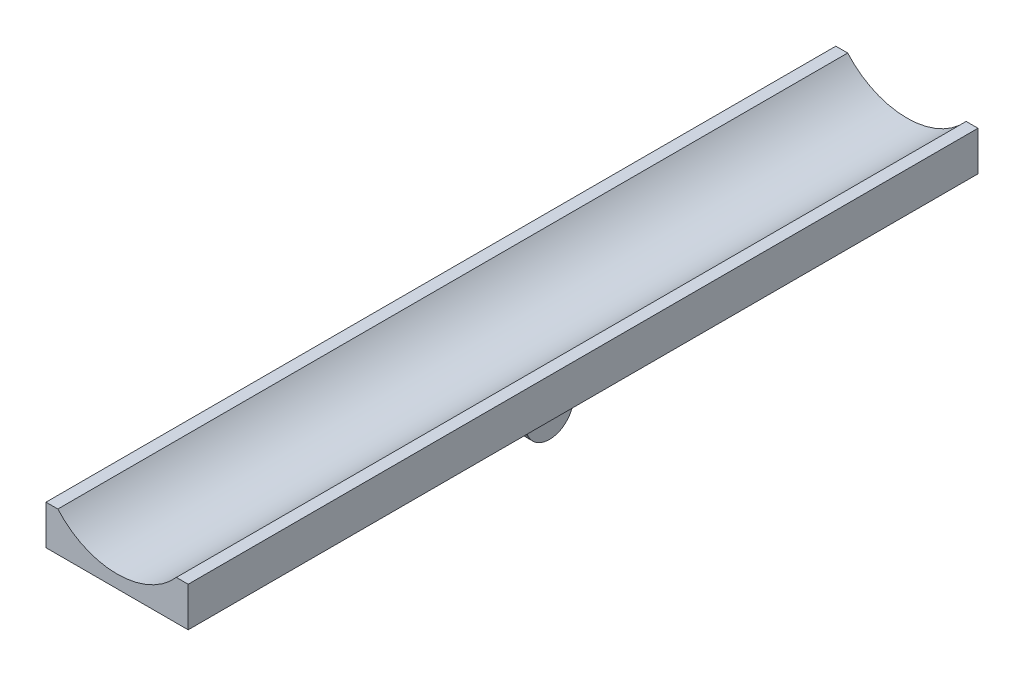
ISO-10303-21;
HEADER;
FILE_DESCRIPTION(('STEP AP214'),'2;1');
FILE_NAME('part.step','',(''),(''),'','','');
FILE_SCHEMA(('AUTOMOTIVE_DESIGN { 1 0 10303 214 1 1 1 1 }'));
ENDSEC;
DATA;
#1=APPLICATION_CONTEXT('core data for automotive mechanical design processes');
#2=APPLICATION_PROTOCOL_DEFINITION('international standard','automotive_design',2000,#1);
#3=PRODUCT_CONTEXT('',#1,'mechanical');
#4=PRODUCT('Part','Part','',(#3));
#5=PRODUCT_RELATED_PRODUCT_CATEGORY('part','',(#4));
#6=PRODUCT_DEFINITION_FORMATION('','',#4);
#7=PRODUCT_DEFINITION_CONTEXT('part definition',#1,'design');
#8=PRODUCT_DEFINITION('design','',#6,#7);
#9=PRODUCT_DEFINITION_SHAPE('','',#8);
#10=(LENGTH_UNIT() NAMED_UNIT(*) SI_UNIT(.MILLI.,.METRE.));
#11=(NAMED_UNIT(*) PLANE_ANGLE_UNIT() SI_UNIT($,.RADIAN.));
#12=(NAMED_UNIT(*) SI_UNIT($,.STERADIAN.) SOLID_ANGLE_UNIT());
#13=UNCERTAINTY_MEASURE_WITH_UNIT(LENGTH_MEASURE(1.E-05),#10,'distance_accuracy_value','');
#14=(GEOMETRIC_REPRESENTATION_CONTEXT(3) GLOBAL_UNCERTAINTY_ASSIGNED_CONTEXT((#13)) GLOBAL_UNIT_ASSIGNED_CONTEXT((#10,
#11,#12)) REPRESENTATION_CONTEXT('',''));
#15=CARTESIAN_POINT('',(0.,0.,0.));
#16=DIRECTION('',(0.,0.,1.));
#17=DIRECTION('',(1.,0.,0.));
#18=AXIS2_PLACEMENT_3D('',#15,#16,#17);
#19=CARTESIAN_POINT('',(15.,16.5,0.));
#20=DIRECTION('',(0.,1.,0.));
#21=DIRECTION('',(0.,0.,-1.));
#22=AXIS2_PLACEMENT_3D('',#19,#20,#21);
#23=PLANE('',#22);
#24=DIRECTION('',(0.,0.,-1.));
#25=VECTOR('',#24,1.);
#26=CARTESIAN_POINT('',(15.,16.5,0.));
#27=LINE('',#26,#25);
#28=CARTESIAN_POINT('',(15.,16.5,100.));
#29=VERTEX_POINT('',#28);
#30=CARTESIAN_POINT('',(15.,16.5,-100.));
#31=VERTEX_POINT('',#30);
#32=EDGE_CURVE('E11',#29,#31,#27,.T.);
#33=ORIENTED_EDGE('',*,*,#32,.F.);
#34=DIRECTION('',(-1.,0.,0.));
#35=VECTOR('',#34,1.);
#36=CARTESIAN_POINT('',(18.,16.5,100.));
#37=LINE('',#36,#35);
#38=CARTESIAN_POINT('',(18.,16.5,100.));
#39=VERTEX_POINT('',#38);
#40=EDGE_CURVE('E231',#39,#29,#37,.T.);
#41=ORIENTED_EDGE('',*,*,#40,.F.);
#42=DIRECTION('',(0.,0.,1.));
#43=VECTOR('',#42,1.);
#44=CARTESIAN_POINT('',(18.,16.5,0.));
#45=LINE('',#44,#43);
#46=CARTESIAN_POINT('',(18.,16.5,-100.));
#47=VERTEX_POINT('',#46);
#48=EDGE_CURVE('E46',#39,#47,#45,.F.);
#49=ORIENTED_EDGE('',*,*,#48,.T.);
#50=DIRECTION('',(1.,0.,0.));
#51=VECTOR('',#50,1.);
#52=CARTESIAN_POINT('',(15.,16.5,-100.));
#53=LINE('',#52,#51);
#54=EDGE_CURVE('E255',#31,#47,#53,.T.);
#55=ORIENTED_EDGE('',*,*,#54,.F.);
#56=EDGE_LOOP('',(#33,#41,#49,#55));
#57=FACE_BOUND('',#56,.T.);
#58=ADVANCED_FACE('F43',(#57),#23,.T.);
#59=CARTESIAN_POINT('',(18.,-1.5,0.));
#60=DIRECTION('',(-1.,0.,0.));
#61=DIRECTION('',(0.,0.,1.));
#62=AXIS2_PLACEMENT_3D('',#59,#60,#61);
#63=PLANE('',#62);
#64=ORIENTED_EDGE('',*,*,#48,.F.);
#65=DIRECTION('',(0.,1.,0.));
#66=VECTOR('',#65,1.);
#67=CARTESIAN_POINT('',(18.,6.5,100.));
#68=LINE('',#67,#66);
#69=CARTESIAN_POINT('',(18.,6.5,100.));
#70=VERTEX_POINT('',#69);
#71=EDGE_CURVE('E228',#70,#39,#68,.T.);
#72=ORIENTED_EDGE('',*,*,#71,.F.);
#73=DIRECTION('',(0.,0.,-1.));
#74=VECTOR('',#73,1.);
#75=CARTESIAN_POINT('',(18.,6.5,92.5));
#76=LINE('',#75,#74);
#77=CARTESIAN_POINT('',(18.,6.5,-100.));
#78=VERTEX_POINT('',#77);
#79=EDGE_CURVE('E259',#70,#78,#76,.T.);
#80=ORIENTED_EDGE('',*,*,#79,.T.);
#81=DIRECTION('',(0.,-1.,0.));
#82=VECTOR('',#81,1.);
#83=CARTESIAN_POINT('',(18.,16.5,-100.));
#84=LINE('',#83,#82);
#85=EDGE_CURVE('E240',#47,#78,#84,.T.);
#86=ORIENTED_EDGE('',*,*,#85,.F.);
#87=EDGE_LOOP('',(#64,#72,#80,#86));
#88=FACE_BOUND('',#87,.T.);
#89=ADVANCED_FACE('F284',(#88),#63,.F.);
#90=CARTESIAN_POINT('',(-15.,16.5,0.));
#91=DIRECTION('',(0.,1.,0.));
#92=DIRECTION('',(0.,0.,-1.));
#93=AXIS2_PLACEMENT_3D('',#90,#91,#92);
#94=PLANE('',#93);
#95=DIRECTION('',(0.,0.,1.));
#96=VECTOR('',#95,1.);
#97=CARTESIAN_POINT('',(-18.,16.5,0.));
#98=LINE('',#97,#96);
#99=CARTESIAN_POINT('',(-18.,16.5,100.));
#100=VERTEX_POINT('',#99);
#101=CARTESIAN_POINT('',(-18.,16.5,-100.));
#102=VERTEX_POINT('',#101);
#103=EDGE_CURVE('E263',#100,#102,#98,.F.);
#104=ORIENTED_EDGE('',*,*,#103,.F.);
#105=DIRECTION('',(-1.,0.,0.));
#106=VECTOR('',#105,1.);
#107=CARTESIAN_POINT('',(-15.,16.5,100.));
#108=LINE('',#107,#106);
#109=CARTESIAN_POINT('',(-15.,16.5,100.));
#110=VERTEX_POINT('',#109);
#111=EDGE_CURVE('E237',#110,#100,#108,.T.);
#112=ORIENTED_EDGE('',*,*,#111,.F.);
#113=DIRECTION('',(0.,0.,-1.));
#114=VECTOR('',#113,1.);
#115=CARTESIAN_POINT('',(-15.,16.5,0.));
#116=LINE('',#115,#114);
#117=CARTESIAN_POINT('',(-15.,16.5,-100.));
#118=VERTEX_POINT('',#117);
#119=EDGE_CURVE('E261',#110,#118,#116,.T.);
#120=ORIENTED_EDGE('',*,*,#119,.T.);
#121=DIRECTION('',(1.,0.,0.));
#122=VECTOR('',#121,1.);
#123=CARTESIAN_POINT('',(-18.,16.5,-100.));
#124=LINE('',#123,#122);
#125=EDGE_CURVE('E249',#102,#118,#124,.T.);
#126=ORIENTED_EDGE('',*,*,#125,.F.);
#127=EDGE_LOOP('',(#104,#112,#120,#126));
#128=FACE_BOUND('',#127,.T.);
#129=ADVANCED_FACE('F268',(#128),#94,.T.);
#130=CARTESIAN_POINT('',(-18.,-1.5,0.));
#131=DIRECTION('',(-1.,0.,0.));
#132=DIRECTION('',(0.,0.,1.));
#133=AXIS2_PLACEMENT_3D('',#130,#131,#132);
#134=PLANE('',#133);
#135=DIRECTION('',(0.,0.,-1.));
#136=VECTOR('',#135,1.);
#137=CARTESIAN_POINT('',(-18.,6.5,92.5));
#138=LINE('',#137,#136);
#139=CARTESIAN_POINT('',(-18.,6.5,100.));
#140=VERTEX_POINT('',#139);
#141=CARTESIAN_POINT('',(-18.,6.5,-100.));
#142=VERTEX_POINT('',#141);
#143=EDGE_CURVE('E258',#140,#142,#138,.T.);
#144=ORIENTED_EDGE('',*,*,#143,.F.);
#145=DIRECTION('',(0.,-1.,0.));
#146=VECTOR('',#145,1.);
#147=CARTESIAN_POINT('',(-18.,16.5,100.));
#148=LINE('',#147,#146);
#149=EDGE_CURVE('E211',#100,#140,#148,.T.);
#150=ORIENTED_EDGE('',*,*,#149,.F.);
#151=ORIENTED_EDGE('',*,*,#103,.T.);
#152=DIRECTION('',(0.,1.,0.));
#153=VECTOR('',#152,1.);
#154=CARTESIAN_POINT('',(-18.,6.5,-100.));
#155=LINE('',#154,#153);
#156=EDGE_CURVE('E246',#142,#102,#155,.T.);
#157=ORIENTED_EDGE('',*,*,#156,.F.);
#158=EDGE_LOOP('',(#144,#150,#151,#157));
#159=FACE_BOUND('',#158,.T.);
#160=ADVANCED_FACE('F289',(#159),#134,.T.);
#161=CARTESIAN_POINT('',(0.,29.7287565553229,-92.5));
#162=DIRECTION('',(0.,0.,1.));
#163=DIRECTION('',(1.,0.,0.));
#164=AXIS2_PLACEMENT_3D('',#161,#162,#163);
#165=CYLINDRICAL_SURFACE('',#164,19.9999999999999);
#166=ORIENTED_EDGE('',*,*,#119,.F.);
#167=CARTESIAN_POINT('',(0.,29.7287565553229,100.));
#168=DIRECTION('',(0.,0.,-1.));
#169=DIRECTION('',(1.,0.,0.));
#170=AXIS2_PLACEMENT_3D('',#167,#168,#169);
#171=CIRCLE('',#170,19.9999999999999);
#172=EDGE_CURVE('E234',#29,#110,#171,.T.);
#173=ORIENTED_EDGE('',*,*,#172,.F.);
#174=ORIENTED_EDGE('',*,*,#32,.T.);
#175=CARTESIAN_POINT('',(0.,29.7287565553229,-100.));
#176=DIRECTION('',(0.,0.,1.));
#177=DIRECTION('',(-1.,0.,0.));
#178=AXIS2_PLACEMENT_3D('',#175,#176,#177);
#179=CIRCLE('',#178,19.9999999999999);
#180=EDGE_CURVE('E252',#118,#31,#179,.T.);
#181=ORIENTED_EDGE('',*,*,#180,.F.);
#182=EDGE_LOOP('',(#166,#173,#174,#181));
#183=FACE_BOUND('',#182,.T.);
#184=ADVANCED_FACE('F276',(#183),#165,.F.);
#185=CARTESIAN_POINT('',(18.,6.5,92.5));
#186=DIRECTION('',(0.,1.,0.));
#187=DIRECTION('',(0.,0.,1.));
#188=AXIS2_PLACEMENT_3D('',#185,#186,#187);
#189=PLANE('',#188);
#190=DIRECTION('',(-1.,0.,0.));
#191=VECTOR('',#190,1.);
#192=CARTESIAN_POINT('',(20.3277234511636,6.5,-86.4999999999999));
#193=LINE('',#192,#191);
#194=CARTESIAN_POINT('',(3.,6.5,-86.4999999999999));
#195=VERTEX_POINT('',#194);
#196=CARTESIAN_POINT('',(-3.,6.5,-86.4999999999999));
#197=VERTEX_POINT('',#196);
#198=EDGE_CURVE('E175',#195,#197,#193,.T.);
#199=ORIENTED_EDGE('',*,*,#198,.F.);
#200=DIRECTION('',(0.,0.,1.));
#201=VECTOR('',#200,1.);
#202=CARTESIAN_POINT('',(3.,6.49999999999999,0.));
#203=LINE('',#202,#201);
#204=CARTESIAN_POINT('',(3.,6.5,-98.5000000000001));
#205=VERTEX_POINT('',#204);
#206=EDGE_CURVE('E176',#205,#195,#203,.T.);
#207=ORIENTED_EDGE('',*,*,#206,.F.);
#208=DIRECTION('',(-1.,0.,0.));
#209=VECTOR('',#208,1.);
#210=CARTESIAN_POINT('',(20.3277234511636,6.5,-98.5000000000001));
#211=LINE('',#210,#209);
#212=CARTESIAN_POINT('',(-3.,6.5,-98.5000000000001));
#213=VERTEX_POINT('',#212);
#214=EDGE_CURVE('E155',#205,#213,#211,.T.);
#215=ORIENTED_EDGE('',*,*,#214,.T.);
#216=DIRECTION('',(0.,0.,1.));
#217=VECTOR('',#216,1.);
#218=CARTESIAN_POINT('',(-3.,6.49999999999999,0.));
#219=LINE('',#218,#217);
#220=EDGE_CURVE('E162',#213,#197,#219,.T.);
#221=ORIENTED_EDGE('',*,*,#220,.T.);
#222=EDGE_LOOP('',(#199,#207,#215,#221));
#223=FACE_BOUND('',#222,.T.);
#224=DIRECTION('',(1.,0.,0.));
#225=VECTOR('',#224,1.);
#226=CARTESIAN_POINT('',(-33.0849528301415,6.5,-10.));
#227=LINE('',#226,#225);
#228=CARTESIAN_POINT('',(-9.50000000000002,6.5,-10.));
#229=VERTEX_POINT('',#228);
#230=CARTESIAN_POINT('',(9.49999999999998,6.5,-9.99999999999999));
#231=VERTEX_POINT('',#230);
#232=EDGE_CURVE('E218',#229,#231,#227,.T.);
#233=ORIENTED_EDGE('',*,*,#232,.F.);
#234=DIRECTION('',(0.,0.,-1.));
#235=VECTOR('',#234,1.);
#236=CARTESIAN_POINT('',(-9.50000000000002,6.5,0.));
#237=LINE('',#236,#235);
#238=CARTESIAN_POINT('',(-9.50000000000002,6.5,10.));
#239=VERTEX_POINT('',#238);
#240=EDGE_CURVE('E200',#239,#229,#237,.T.);
#241=ORIENTED_EDGE('',*,*,#240,.F.);
#242=DIRECTION('',(1.,0.,0.));
#243=VECTOR('',#242,1.);
#244=CARTESIAN_POINT('',(-33.0849528301415,6.5,10.));
#245=LINE('',#244,#243);
#246=CARTESIAN_POINT('',(9.49999999999998,6.5,10.));
#247=VERTEX_POINT('',#246);
#248=EDGE_CURVE('E215',#239,#247,#245,.T.);
#249=ORIENTED_EDGE('',*,*,#248,.T.);
#250=DIRECTION('',(0.,0.,-1.));
#251=VECTOR('',#250,1.);
#252=CARTESIAN_POINT('',(9.49999999999998,6.5,0.));
#253=LINE('',#252,#251);
#254=EDGE_CURVE('E179',#247,#231,#253,.T.);
#255=ORIENTED_EDGE('',*,*,#254,.T.);
#256=EDGE_LOOP('',(#233,#241,#249,#255));
#257=FACE_BOUND('',#256,.T.);
#258=ORIENTED_EDGE('',*,*,#143,.T.);
#259=DIRECTION('',(-1.,0.,0.));
#260=VECTOR('',#259,1.);
#261=CARTESIAN_POINT('',(18.,6.5,-100.));
#262=LINE('',#261,#260);
#263=EDGE_CURVE('E243',#78,#142,#262,.T.);
#264=ORIENTED_EDGE('',*,*,#263,.F.);
#265=ORIENTED_EDGE('',*,*,#79,.F.);
#266=DIRECTION('',(1.,0.,0.));
#267=VECTOR('',#266,1.);
#268=CARTESIAN_POINT('',(-18.,6.5,100.));
#269=LINE('',#268,#267);
#270=EDGE_CURVE('E225',#140,#70,#269,.T.);
#271=ORIENTED_EDGE('',*,*,#270,.F.);
#272=EDGE_LOOP('',(#258,#264,#265,#271));
#273=FACE_BOUND('',#272,.T.);
#274=ADVANCED_FACE('F291',(#223,#257,#273),#189,.F.);
#275=CARTESIAN_POINT('',(0.,29.7287565553229,-100.));
#276=DIRECTION('',(0.,0.,-1.));
#277=DIRECTION('',(-1.,0.,0.));
#278=AXIS2_PLACEMENT_3D('',#275,#276,#277);
#279=PLANE('',#278);
#280=ORIENTED_EDGE('',*,*,#85,.T.);
#281=ORIENTED_EDGE('',*,*,#263,.T.);
#282=ORIENTED_EDGE('',*,*,#156,.T.);
#283=ORIENTED_EDGE('',*,*,#125,.T.);
#284=ORIENTED_EDGE('',*,*,#180,.T.);
#285=ORIENTED_EDGE('',*,*,#54,.T.);
#286=EDGE_LOOP('',(#280,#281,#282,#283,#284,#285));
#287=FACE_BOUND('',#286,.T.);
#288=ADVANCED_FACE('F273',(#287),#279,.T.);
#289=CARTESIAN_POINT('',(0.,29.7287565553229,100.));
#290=DIRECTION('',(0.,0.,1.));
#291=DIRECTION('',(1.,0.,0.));
#292=AXIS2_PLACEMENT_3D('',#289,#290,#291);
#293=PLANE('',#292);
#294=ORIENTED_EDGE('',*,*,#149,.T.);
#295=ORIENTED_EDGE('',*,*,#270,.T.);
#296=ORIENTED_EDGE('',*,*,#71,.T.);
#297=ORIENTED_EDGE('',*,*,#40,.T.);
#298=ORIENTED_EDGE('',*,*,#172,.T.);
#299=ORIENTED_EDGE('',*,*,#111,.T.);
#300=EDGE_LOOP('',(#294,#295,#296,#297,#298,#299));
#301=FACE_BOUND('',#300,.T.);
#302=ADVANCED_FACE('F280',(#301),#293,.T.);
#303=CARTESIAN_POINT('',(-33.0849528301415,0.,0.));
#304=DIRECTION('',(1.,0.,0.));
#305=DIRECTION('',(0.,0.,-1.));
#306=AXIS2_PLACEMENT_3D('',#303,#304,#305);
#307=CYLINDRICAL_SURFACE('',#306,2.);
#308=CARTESIAN_POINT('',(-9.50000000000002,0.,0.));
#309=DIRECTION('',(-1.,0.,0.));
#310=DIRECTION('',(0.,0.,1.));
#311=AXIS2_PLACEMENT_3D('',#308,#309,#310);
#312=CIRCLE('',#311,2.);
#313=CARTESIAN_POINT('',(-9.50000000000002,0.,2.));
#314=VERTEX_POINT('',#313);
#315=EDGE_CURVE('E208',#314,#314,#312,.F.);
#316=ORIENTED_EDGE('',*,*,#315,.F.);
#317=EDGE_LOOP('',(#316));
#318=FACE_BOUND('',#317,.T.);
#319=CARTESIAN_POINT('',(9.49999999999998,0.,0.));
#320=DIRECTION('',(1.,0.,0.));
#321=DIRECTION('',(0.,0.,-1.));
#322=AXIS2_PLACEMENT_3D('',#319,#320,#321);
#323=CIRCLE('',#322,2.);
#324=CARTESIAN_POINT('',(9.49999999999998,0.,-2.));
#325=VERTEX_POINT('',#324);
#326=EDGE_CURVE('E194',#325,#325,#323,.T.);
#327=ORIENTED_EDGE('',*,*,#326,.T.);
#328=EDGE_LOOP('',(#327));
#329=FACE_BOUND('',#328,.T.);
#330=ADVANCED_FACE('F331',(#318,#329),#307,.F.);
#331=CARTESIAN_POINT('',(-33.0849528301415,-2.70274758413108,-5.3567859296856));
#332=DIRECTION('',(0.,-0.450457930688488,-0.892797654947551));
#333=DIRECTION('',(0.,0.892797654947551,-0.450457930688488));
#334=AXIS2_PLACEMENT_3D('',#331,#332,#333);
#335=PLANE('',#334);
#336=DIRECTION('',(1.,0.,0.));
#337=VECTOR('',#336,1.);
#338=CARTESIAN_POINT('',(-33.0849528301415,-2.70274758413071,-5.3567859296856));
#339=LINE('',#338,#337);
#340=CARTESIAN_POINT('',(-9.50000000000002,-2.70274758413079,-5.35678592968575));
#341=VERTEX_POINT('',#340);
#342=CARTESIAN_POINT('',(9.49999999999998,-2.70274758413079,-5.35678592968575));
#343=VERTEX_POINT('',#342);
#344=EDGE_CURVE('E207',#341,#343,#339,.T.);
#345=ORIENTED_EDGE('',*,*,#344,.F.);
#346=DIRECTION('',(0.,0.892797654947551,-0.450457930688488));
#347=VECTOR('',#346,1.);
#348=CARTESIAN_POINT('',(-9.50000000000002,-2.70274758413108,-5.3567859296856));
#349=LINE('',#348,#347);
#350=EDGE_CURVE('E212',#341,#229,#349,.T.);
#351=ORIENTED_EDGE('',*,*,#350,.T.);
#352=ORIENTED_EDGE('',*,*,#232,.T.);
#353=DIRECTION('',(0.,0.892797654947551,-0.450457930688488));
#354=VECTOR('',#353,1.);
#355=CARTESIAN_POINT('',(9.49999999999998,-2.70274758413108,-5.3567859296856));
#356=LINE('',#355,#354);
#357=EDGE_CURVE('E65',#343,#231,#356,.T.);
#358=ORIENTED_EDGE('',*,*,#357,.F.);
#359=EDGE_LOOP('',(#345,#351,#352,#358));
#360=FACE_BOUND('',#359,.T.);
#361=ADVANCED_FACE('F339',(#360),#335,.T.);
#362=CARTESIAN_POINT('',(-33.0849528301415,-2.7027475841311,5.35678592968521));
#363=DIRECTION('',(0.,0.450457930688517,-0.892797654947536));
#364=DIRECTION('',(0.,0.892797654947536,0.450457930688517));
#365=AXIS2_PLACEMENT_3D('',#362,#363,#364);
#366=PLANE('',#365);
#367=DIRECTION('',(0.,0.892797654947536,0.450457930688517));
#368=VECTOR('',#367,1.);
#369=CARTESIAN_POINT('',(-9.50000000000002,-2.7027475841311,5.35678592968521));
#370=LINE('',#369,#368);
#371=CARTESIAN_POINT('',(-9.50000000000002,-2.70274758413096,5.35678592968528));
#372=VERTEX_POINT('',#371);
#373=EDGE_CURVE('E202',#372,#239,#370,.T.);
#374=ORIENTED_EDGE('',*,*,#373,.F.);
#375=DIRECTION('',(1.,0.,0.));
#376=VECTOR('',#375,1.);
#377=CARTESIAN_POINT('',(-33.0849528301415,-2.70274758413096,5.35678592968528));
#378=LINE('',#377,#376);
#379=CARTESIAN_POINT('',(9.49999999999998,-2.70274758413096,5.35678592968528));
#380=VERTEX_POINT('',#379);
#381=EDGE_CURVE('E213',#372,#380,#378,.T.);
#382=ORIENTED_EDGE('',*,*,#381,.T.);
#383=DIRECTION('',(0.,0.892797654947536,0.450457930688517));
#384=VECTOR('',#383,1.);
#385=CARTESIAN_POINT('',(9.49999999999998,-2.7027475841311,5.35678592968521));
#386=LINE('',#385,#384);
#387=EDGE_CURVE('E197',#380,#247,#386,.T.);
#388=ORIENTED_EDGE('',*,*,#387,.T.);
#389=ORIENTED_EDGE('',*,*,#248,.F.);
#390=EDGE_LOOP('',(#374,#382,#388,#389));
#391=FACE_BOUND('',#390,.T.);
#392=ADVANCED_FACE('F348',(#391),#366,.F.);
#393=CARTESIAN_POINT('',(-33.0849528301415,0.,0.));
#394=DIRECTION('',(1.,0.,0.));
#395=DIRECTION('',(0.,0.,-1.));
#396=AXIS2_PLACEMENT_3D('',#393,#394,#395);
#397=CYLINDRICAL_SURFACE('',#396,6.);
#398=ORIENTED_EDGE('',*,*,#381,.F.);
#399=CARTESIAN_POINT('',(-9.50000000000002,0.,0.));
#400=DIRECTION('',(-1.,0.,0.));
#401=DIRECTION('',(0.,0.,1.));
#402=AXIS2_PLACEMENT_3D('',#399,#400,#401);
#403=CIRCLE('',#402,6.);
#404=EDGE_CURVE('E204',#372,#341,#403,.F.);
#405=ORIENTED_EDGE('',*,*,#404,.T.);
#406=ORIENTED_EDGE('',*,*,#344,.T.);
#407=CARTESIAN_POINT('',(9.49999999999998,0.,0.));
#408=DIRECTION('',(1.,0.,0.));
#409=DIRECTION('',(0.,0.,-1.));
#410=AXIS2_PLACEMENT_3D('',#407,#408,#409);
#411=CIRCLE('',#410,6.);
#412=EDGE_CURVE('E192',#380,#343,#411,.T.);
#413=ORIENTED_EDGE('',*,*,#412,.F.);
#414=EDGE_LOOP('',(#398,#405,#406,#413));
#415=FACE_BOUND('',#414,.T.);
#416=ADVANCED_FACE('F357',(#415),#397,.T.);
#417=CARTESIAN_POINT('',(-9.50000000000002,-139.942914361772,-3.99758926526018));
#418=DIRECTION('',(-1.,0.,0.));
#419=DIRECTION('',(0.,0.0285542090375727,-0.999592245441229));
#420=AXIS2_PLACEMENT_3D('',#417,#418,#419);
#421=PLANE('',#420);
#422=ORIENTED_EDGE('',*,*,#404,.F.);
#423=ORIENTED_EDGE('',*,*,#373,.T.);
#424=ORIENTED_EDGE('',*,*,#240,.T.);
#425=ORIENTED_EDGE('',*,*,#350,.F.);
#426=EDGE_LOOP('',(#422,#423,#424,#425));
#427=FACE_BOUND('',#426,.T.);
#428=ORIENTED_EDGE('',*,*,#315,.T.);
#429=EDGE_LOOP('',(#428));
#430=FACE_BOUND('',#429,.T.);
#431=ADVANCED_FACE('F366',(#427,#430),#421,.T.);
#432=CARTESIAN_POINT('',(9.49999999999998,-139.942914361772,-3.99758926526018));
#433=DIRECTION('',(1.,0.,0.));
#434=DIRECTION('',(0.,0.0285542090375727,-0.999592245441229));
#435=AXIS2_PLACEMENT_3D('',#432,#433,#434);
#436=PLANE('',#435);
#437=ORIENTED_EDGE('',*,*,#326,.F.);
#438=EDGE_LOOP('',(#437));
#439=FACE_BOUND('',#438,.T.);
#440=ORIENTED_EDGE('',*,*,#387,.F.);
#441=ORIENTED_EDGE('',*,*,#412,.T.);
#442=ORIENTED_EDGE('',*,*,#357,.T.);
#443=ORIENTED_EDGE('',*,*,#254,.F.);
#444=EDGE_LOOP('',(#440,#441,#442,#443));
#445=FACE_BOUND('',#444,.T.);
#446=ADVANCED_FACE('F374',(#439,#445),#436,.T.);
#447=CARTESIAN_POINT('',(20.3277234511636,0.,-92.5));
#448=DIRECTION('',(-1.,0.,0.));
#449=DIRECTION('',(0.,0.,1.));
#450=AXIS2_PLACEMENT_3D('',#447,#448,#449);
#451=CYLINDRICAL_SURFACE('',#450,6.00000000000009);
#452=CARTESIAN_POINT('',(3.,0.,-92.5));
#453=DIRECTION('',(1.,0.,0.));
#454=DIRECTION('',(0.,1.,0.));
#455=AXIS2_PLACEMENT_3D('',#452,#453,#454);
#456=CIRCLE('',#455,6.00000000000009);
#457=CARTESIAN_POINT('',(3.,0.,-86.4999999999999));
#458=VERTEX_POINT('',#457);
#459=CARTESIAN_POINT('',(3.,0.,-98.5000000000001));
#460=VERTEX_POINT('',#459);
#461=EDGE_CURVE('E181',#458,#460,#456,.T.);
#462=ORIENTED_EDGE('',*,*,#461,.F.);
#463=DIRECTION('',(-1.,0.,0.));
#464=VECTOR('',#463,1.);
#465=CARTESIAN_POINT('',(20.3277234511636,0.,-86.4999999999999));
#466=LINE('',#465,#464);
#467=CARTESIAN_POINT('',(-3.,0.,-86.4999999999999));
#468=VERTEX_POINT('',#467);
#469=EDGE_CURVE('E156',#458,#468,#466,.T.);
#470=ORIENTED_EDGE('',*,*,#469,.T.);
#471=CARTESIAN_POINT('',(-3.,0.,-92.5));
#472=DIRECTION('',(-1.,0.,0.));
#473=DIRECTION('',(0.,-1.,0.));
#474=AXIS2_PLACEMENT_3D('',#471,#472,#473);
#475=CIRCLE('',#474,6.00000000000009);
#476=CARTESIAN_POINT('',(-3.,0.,-98.5000000000001));
#477=VERTEX_POINT('',#476);
#478=EDGE_CURVE('E160',#468,#477,#475,.F.);
#479=ORIENTED_EDGE('',*,*,#478,.T.);
#480=DIRECTION('',(-1.,0.,0.));
#481=VECTOR('',#480,1.);
#482=CARTESIAN_POINT('',(20.3277234511636,0.,-98.5000000000001));
#483=LINE('',#482,#481);
#484=EDGE_CURVE('E144',#460,#477,#483,.T.);
#485=ORIENTED_EDGE('',*,*,#484,.F.);
#486=EDGE_LOOP('',(#462,#470,#479,#485));
#487=FACE_BOUND('',#486,.T.);
#488=ADVANCED_FACE('F165',(#487),#451,.T.);
#489=CARTESIAN_POINT('',(20.3277234511636,0.,-98.5000000000001));
#490=DIRECTION('',(0.,0.,1.));
#491=DIRECTION('',(1.,0.,0.));
#492=AXIS2_PLACEMENT_3D('',#489,#490,#491);
#493=PLANE('',#492);
#494=DIRECTION('',(0.,1.,0.));
#495=VECTOR('',#494,1.);
#496=CARTESIAN_POINT('',(3.,0.,-98.5000000000001));
#497=LINE('',#496,#495);
#498=EDGE_CURVE('E150',#460,#205,#497,.T.);
#499=ORIENTED_EDGE('',*,*,#498,.F.);
#500=ORIENTED_EDGE('',*,*,#484,.T.);
#501=DIRECTION('',(0.,1.,0.));
#502=VECTOR('',#501,1.);
#503=CARTESIAN_POINT('',(-3.,0.,-98.5000000000001));
#504=LINE('',#503,#502);
#505=EDGE_CURVE('E147',#477,#213,#504,.T.);
#506=ORIENTED_EDGE('',*,*,#505,.T.);
#507=ORIENTED_EDGE('',*,*,#214,.F.);
#508=EDGE_LOOP('',(#499,#500,#506,#507));
#509=FACE_BOUND('',#508,.T.);
#510=ADVANCED_FACE('F146',(#509),#493,.F.);
#511=CARTESIAN_POINT('',(20.3277234511636,0.,-92.5));
#512=DIRECTION('',(-1.,0.,0.));
#513=DIRECTION('',(0.,0.,1.));
#514=AXIS2_PLACEMENT_3D('',#511,#512,#513);
#515=CYLINDRICAL_SURFACE('',#514,2.);
#516=CARTESIAN_POINT('',(3.,0.,-92.5));
#517=DIRECTION('',(1.,0.,0.));
#518=DIRECTION('',(0.,1.,0.));
#519=AXIS2_PLACEMENT_3D('',#516,#517,#518);
#520=CIRCLE('',#519,2.);
#521=CARTESIAN_POINT('',(3.,2.00000000000003,-92.5));
#522=VERTEX_POINT('',#521);
#523=EDGE_CURVE('E172',#522,#522,#520,.T.);
#524=ORIENTED_EDGE('',*,*,#523,.T.);
#525=EDGE_LOOP('',(#524));
#526=FACE_BOUND('',#525,.T.);
#527=CARTESIAN_POINT('',(-3.,0.,-92.5));
#528=DIRECTION('',(-1.,0.,0.));
#529=DIRECTION('',(0.,-1.,0.));
#530=AXIS2_PLACEMENT_3D('',#527,#528,#529);
#531=CIRCLE('',#530,2.);
#532=CARTESIAN_POINT('',(-3.,-1.99999999999996,-92.5));
#533=VERTEX_POINT('',#532);
#534=EDGE_CURVE('E163',#533,#533,#531,.F.);
#535=ORIENTED_EDGE('',*,*,#534,.F.);
#536=EDGE_LOOP('',(#535));
#537=FACE_BOUND('',#536,.T.);
#538=ADVANCED_FACE('F401',(#526,#537),#515,.F.);
#539=CARTESIAN_POINT('',(20.3277234511636,-1.84681330057839E-13,-86.4999999999999));
#540=DIRECTION('',(0.,0.,-1.));
#541=DIRECTION('',(0.,1.,0.));
#542=AXIS2_PLACEMENT_3D('',#539,#540,#541);
#543=PLANE('',#542);
#544=DIRECTION('',(0.,-1.,0.));
#545=VECTOR('',#544,1.);
#546=CARTESIAN_POINT('',(3.,-1.84681325316413E-13,-86.4999999999999));
#547=LINE('',#546,#545);
#548=EDGE_CURVE('E183',#195,#458,#547,.T.);
#549=ORIENTED_EDGE('',*,*,#548,.F.);
#550=ORIENTED_EDGE('',*,*,#198,.T.);
#551=DIRECTION('',(0.,-1.,0.));
#552=VECTOR('',#551,1.);
#553=CARTESIAN_POINT('',(-3.,-1.84681334799266E-13,-86.4999999999999));
#554=LINE('',#553,#552);
#555=EDGE_CURVE('E57',#197,#468,#554,.T.);
#556=ORIENTED_EDGE('',*,*,#555,.T.);
#557=ORIENTED_EDGE('',*,*,#469,.F.);
#558=EDGE_LOOP('',(#549,#550,#556,#557));
#559=FACE_BOUND('',#558,.T.);
#560=ADVANCED_FACE('F410',(#559),#543,.F.);
#561=CARTESIAN_POINT('',(3.,-108.921504767655,-77.1342654211071));
#562=DIRECTION('',(1.,0.,0.));
#563=DIRECTION('',(0.,0.990195497887811,-0.139688496171695));
#564=AXIS2_PLACEMENT_3D('',#561,#562,#563);
#565=PLANE('',#564);
#566=ORIENTED_EDGE('',*,*,#523,.F.);
#567=EDGE_LOOP('',(#566));
#568=FACE_BOUND('',#567,.T.);
#569=ORIENTED_EDGE('',*,*,#548,.T.);
#570=ORIENTED_EDGE('',*,*,#461,.T.);
#571=ORIENTED_EDGE('',*,*,#498,.T.);
#572=ORIENTED_EDGE('',*,*,#206,.T.);
#573=EDGE_LOOP('',(#569,#570,#571,#572));
#574=FACE_BOUND('',#573,.T.);
#575=ADVANCED_FACE('F420',(#568,#574),#565,.T.);
#576=CARTESIAN_POINT('',(-3.,-108.921504767655,-77.1342654211071));
#577=DIRECTION('',(-1.,0.,0.));
#578=DIRECTION('',(0.,0.990195497887811,-0.139688496171695));
#579=AXIS2_PLACEMENT_3D('',#576,#577,#578);
#580=PLANE('',#579);
#581=ORIENTED_EDGE('',*,*,#478,.F.);
#582=ORIENTED_EDGE('',*,*,#555,.F.);
#583=ORIENTED_EDGE('',*,*,#220,.F.);
#584=ORIENTED_EDGE('',*,*,#505,.F.);
#585=EDGE_LOOP('',(#581,#582,#583,#584));
#586=FACE_BOUND('',#585,.T.);
#587=ORIENTED_EDGE('',*,*,#534,.T.);
#588=EDGE_LOOP('',(#587));
#589=FACE_BOUND('',#588,.T.);
#590=ADVANCED_FACE('F158',(#586,#589),#580,.T.);
#591=CLOSED_SHELL('',(#58,#89,#129,#160,#184,#274,#288,#302,#330,#361,#392,#416,#431,#446,#488,
#510,#538,#560,#575,#590));
#592=MANIFOLD_SOLID_BREP('B2',#591);
#593=ADVANCED_BREP_SHAPE_REPRESENTATION('',(#18,#592),#14);
#594=SHAPE_DEFINITION_REPRESENTATION(#9,#593);
ENDSEC;
END-ISO-10303-21;
